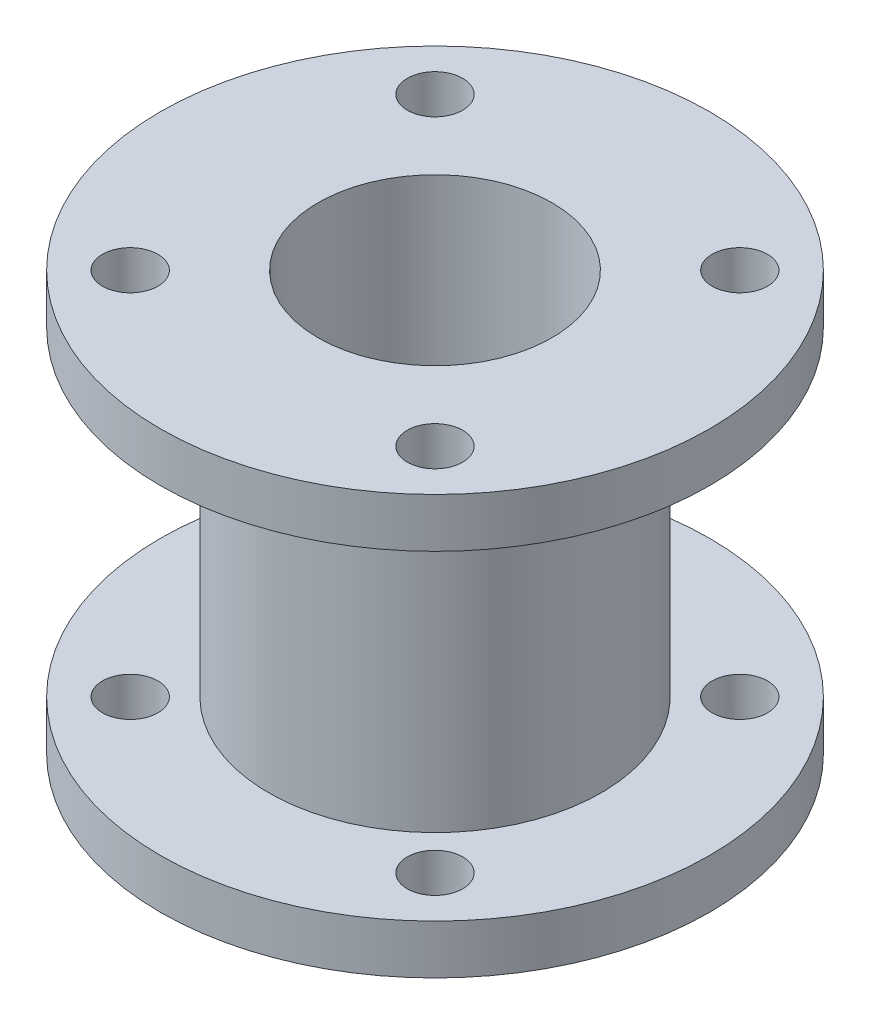
ISO-10303-21;
HEADER;
FILE_DESCRIPTION(('STEP AP214'),'2;1');
FILE_NAME('part.step','',(''),(''),'','','');
FILE_SCHEMA(('AUTOMOTIVE_DESIGN { 1 0 10303 214 1 1 1 1 }'));
ENDSEC;
DATA;
#1=APPLICATION_CONTEXT('core data for automotive mechanical design processes');
#2=APPLICATION_PROTOCOL_DEFINITION('international standard','automotive_design',2000,#1);
#3=PRODUCT_CONTEXT('',#1,'mechanical');
#4=PRODUCT('Part','Part','',(#3));
#5=PRODUCT_RELATED_PRODUCT_CATEGORY('part','',(#4));
#6=PRODUCT_DEFINITION_FORMATION('','',#4);
#7=PRODUCT_DEFINITION_CONTEXT('part definition',#1,'design');
#8=PRODUCT_DEFINITION('design','',#6,#7);
#9=PRODUCT_DEFINITION_SHAPE('','',#8);
#10=(LENGTH_UNIT() NAMED_UNIT(*) SI_UNIT(.MILLI.,.METRE.));
#11=(NAMED_UNIT(*) PLANE_ANGLE_UNIT() SI_UNIT($,.RADIAN.));
#12=(NAMED_UNIT(*) SI_UNIT($,.STERADIAN.) SOLID_ANGLE_UNIT());
#13=UNCERTAINTY_MEASURE_WITH_UNIT(LENGTH_MEASURE(1.E-05),#10,'distance_accuracy_value','');
#14=(GEOMETRIC_REPRESENTATION_CONTEXT(3) GLOBAL_UNCERTAINTY_ASSIGNED_CONTEXT((#13)) GLOBAL_UNIT_ASSIGNED_CONTEXT((#10,
#11,#12)) REPRESENTATION_CONTEXT('',''));
#15=CARTESIAN_POINT('',(0.,0.,0.));
#16=DIRECTION('',(0.,0.,1.));
#17=DIRECTION('',(1.,0.,0.));
#18=AXIS2_PLACEMENT_3D('',#15,#16,#17);
#19=CARTESIAN_POINT('',(9.5,30.,0.));
#20=DIRECTION('',(0.,1.,0.));
#21=DIRECTION('',(0.,0.,1.));
#22=AXIS2_PLACEMENT_3D('',#19,#20,#21);
#23=PLANE('',#22);
#24=CARTESIAN_POINT('',(-12.3743686707646,30.,12.3743686707646));
#25=DIRECTION('',(0.,-1.,0.));
#26=DIRECTION('',(0.,0.,-1.));
#27=AXIS2_PLACEMENT_3D('',#24,#25,#26);
#28=CIRCLE('',#27,2.25);
#29=CARTESIAN_POINT('',(-12.3743686707646,30.,10.1243686707646));
#30=VERTEX_POINT('',#29);
#31=EDGE_CURVE('E129',#30,#30,#28,.T.);
#32=ORIENTED_EDGE('',*,*,#31,.T.);
#33=EDGE_LOOP('',(#32));
#34=FACE_BOUND('',#33,.T.);
#35=CARTESIAN_POINT('',(12.3743686707646,30.,12.3743686707646));
#36=DIRECTION('',(0.,-1.,0.));
#37=DIRECTION('',(0.,0.,-1.));
#38=AXIS2_PLACEMENT_3D('',#35,#36,#37);
#39=CIRCLE('',#38,2.25);
#40=CARTESIAN_POINT('',(12.3743686707646,30.,10.1243686707646));
#41=VERTEX_POINT('',#40);
#42=EDGE_CURVE('E57',#41,#41,#39,.T.);
#43=ORIENTED_EDGE('',*,*,#42,.T.);
#44=EDGE_LOOP('',(#43));
#45=FACE_BOUND('',#44,.T.);
#46=CARTESIAN_POINT('',(12.3743686707646,30.,-12.3743686707646));
#47=DIRECTION('',(0.,-1.,0.));
#48=DIRECTION('',(0.,0.,-1.));
#49=AXIS2_PLACEMENT_3D('',#46,#47,#48);
#50=CIRCLE('',#49,2.25);
#51=CARTESIAN_POINT('',(12.3743686707646,30.,-14.6243686707646));
#52=VERTEX_POINT('',#51);
#53=EDGE_CURVE('E53',#52,#52,#50,.T.);
#54=ORIENTED_EDGE('',*,*,#53,.T.);
#55=EDGE_LOOP('',(#54));
#56=FACE_BOUND('',#55,.T.);
#57=CARTESIAN_POINT('',(-12.3743686707646,30.,-12.3743686707646));
#58=DIRECTION('',(0.,-1.,0.));
#59=DIRECTION('',(0.,0.,-1.));
#60=AXIS2_PLACEMENT_3D('',#57,#58,#59);
#61=CIRCLE('',#60,2.25);
#62=CARTESIAN_POINT('',(-12.3743686707646,30.,-14.6243686707646));
#63=VERTEX_POINT('',#62);
#64=EDGE_CURVE('E49',#63,#63,#61,.T.);
#65=ORIENTED_EDGE('',*,*,#64,.T.);
#66=EDGE_LOOP('',(#65));
#67=FACE_BOUND('',#66,.T.);
#68=CARTESIAN_POINT('',(0.,30.,0.));
#69=DIRECTION('',(0.,-1.,0.));
#70=DIRECTION('',(0.,0.,-1.));
#71=AXIS2_PLACEMENT_3D('',#68,#69,#70);
#72=CIRCLE('',#71,9.5);
#73=CARTESIAN_POINT('',(0.,30.,-9.5));
#74=VERTEX_POINT('',#73);
#75=EDGE_CURVE('E10',#74,#74,#72,.T.);
#76=ORIENTED_EDGE('',*,*,#75,.T.);
#77=EDGE_LOOP('',(#76));
#78=FACE_BOUND('',#77,.T.);
#79=CARTESIAN_POINT('',(0.,30.,0.));
#80=DIRECTION('',(0.,-1.,0.));
#81=DIRECTION('',(0.,0.,-1.));
#82=AXIS2_PLACEMENT_3D('',#79,#80,#81);
#83=CIRCLE('',#82,22.3);
#84=CARTESIAN_POINT('',(0.,30.,-22.3));
#85=VERTEX_POINT('',#84);
#86=EDGE_CURVE('E86',#85,#85,#83,.T.);
#87=ORIENTED_EDGE('',*,*,#86,.F.);
#88=EDGE_LOOP('',(#87));
#89=FACE_BOUND('',#88,.T.);
#90=ADVANCED_FACE('F29',(#34,#45,#56,#67,#78,#89),#23,.T.);
#91=CARTESIAN_POINT('',(0.,0.,0.));
#92=DIRECTION('',(0.,-1.,0.));
#93=DIRECTION('',(0.,0.,-1.));
#94=AXIS2_PLACEMENT_3D('',#91,#92,#93);
#95=CYLINDRICAL_SURFACE('',#94,9.5);
#96=CARTESIAN_POINT('',(0.,-4.,0.));
#97=DIRECTION('',(0.,-1.,0.));
#98=DIRECTION('',(0.,0.,-1.));
#99=AXIS2_PLACEMENT_3D('',#96,#97,#98);
#100=CIRCLE('',#99,9.5);
#101=CARTESIAN_POINT('',(0.,-4.,-9.5));
#102=VERTEX_POINT('',#101);
#103=EDGE_CURVE('E36',#102,#102,#100,.T.);
#104=ORIENTED_EDGE('',*,*,#103,.T.);
#105=EDGE_LOOP('',(#104));
#106=FACE_BOUND('',#105,.T.);
#107=ORIENTED_EDGE('',*,*,#75,.F.);
#108=EDGE_LOOP('',(#107));
#109=FACE_BOUND('',#108,.T.);
#110=ADVANCED_FACE('F118',(#106,#109),#95,.F.);
#111=CARTESIAN_POINT('',(22.3,-4.,0.));
#112=DIRECTION('',(0.,-1.,0.));
#113=DIRECTION('',(0.,0.,-1.));
#114=AXIS2_PLACEMENT_3D('',#111,#112,#113);
#115=PLANE('',#114);
#116=CARTESIAN_POINT('',(-12.3743686707646,-4.,12.3743686707646));
#117=DIRECTION('',(0.,-1.,0.));
#118=DIRECTION('',(0.,0.,-1.));
#119=AXIS2_PLACEMENT_3D('',#116,#117,#118);
#120=CIRCLE('',#119,2.24999999999999);
#121=CARTESIAN_POINT('',(-12.3743686707646,-4.,10.1243686707646));
#122=VERTEX_POINT('',#121);
#123=EDGE_CURVE('E187',#122,#122,#120,.T.);
#124=ORIENTED_EDGE('',*,*,#123,.F.);
#125=EDGE_LOOP('',(#124));
#126=FACE_BOUND('',#125,.T.);
#127=CARTESIAN_POINT('',(12.3743686707646,-4.,12.3743686707646));
#128=DIRECTION('',(0.,-1.,0.));
#129=DIRECTION('',(0.,0.,-1.));
#130=AXIS2_PLACEMENT_3D('',#127,#128,#129);
#131=CIRCLE('',#130,2.24999999999999);
#132=CARTESIAN_POINT('',(12.3743686707646,-4.,10.1243686707646));
#133=VERTEX_POINT('',#132);
#134=EDGE_CURVE('E64',#133,#133,#131,.T.);
#135=ORIENTED_EDGE('',*,*,#134,.F.);
#136=EDGE_LOOP('',(#135));
#137=FACE_BOUND('',#136,.T.);
#138=CARTESIAN_POINT('',(12.3743686707646,-4.,-12.3743686707646));
#139=DIRECTION('',(0.,-1.,0.));
#140=DIRECTION('',(0.,0.,-1.));
#141=AXIS2_PLACEMENT_3D('',#138,#139,#140);
#142=CIRCLE('',#141,2.24999999999999);
#143=CARTESIAN_POINT('',(12.3743686707646,-4.,-14.6243686707646));
#144=VERTEX_POINT('',#143);
#145=EDGE_CURVE('E61',#144,#144,#142,.T.);
#146=ORIENTED_EDGE('',*,*,#145,.F.);
#147=EDGE_LOOP('',(#146));
#148=FACE_BOUND('',#147,.T.);
#149=CARTESIAN_POINT('',(-12.3743686707646,-4.,-12.3743686707646));
#150=DIRECTION('',(0.,-1.,0.));
#151=DIRECTION('',(0.,0.,-1.));
#152=AXIS2_PLACEMENT_3D('',#149,#150,#151);
#153=CIRCLE('',#152,2.24999999999999);
#154=CARTESIAN_POINT('',(-12.3743686707646,-4.,-14.6243686707646));
#155=VERTEX_POINT('',#154);
#156=EDGE_CURVE('E79',#155,#155,#153,.T.);
#157=ORIENTED_EDGE('',*,*,#156,.F.);
#158=EDGE_LOOP('',(#157));
#159=FACE_BOUND('',#158,.T.);
#160=CARTESIAN_POINT('',(0.,-4.,0.));
#161=DIRECTION('',(0.,-1.,0.));
#162=DIRECTION('',(0.,0.,-1.));
#163=AXIS2_PLACEMENT_3D('',#160,#161,#162);
#164=CIRCLE('',#163,22.3);
#165=CARTESIAN_POINT('',(0.,-4.,-22.3));
#166=VERTEX_POINT('',#165);
#167=EDGE_CURVE('E41',#166,#166,#164,.T.);
#168=ORIENTED_EDGE('',*,*,#167,.T.);
#169=EDGE_LOOP('',(#168));
#170=FACE_BOUND('',#169,.T.);
#171=ORIENTED_EDGE('',*,*,#103,.F.);
#172=EDGE_LOOP('',(#171));
#173=FACE_BOUND('',#172,.T.);
#174=ADVANCED_FACE('F103',(#126,#137,#148,#159,#170,#173),#115,.T.);
#175=CARTESIAN_POINT('',(0.,0.,0.));
#176=DIRECTION('',(0.,-1.,0.));
#177=DIRECTION('',(0.,0.,-1.));
#178=AXIS2_PLACEMENT_3D('',#175,#176,#177);
#179=CYLINDRICAL_SURFACE('',#178,22.3);
#180=CARTESIAN_POINT('',(0.,0.,0.));
#181=DIRECTION('',(0.,-1.,0.));
#182=DIRECTION('',(0.,0.,-1.));
#183=AXIS2_PLACEMENT_3D('',#180,#181,#182);
#184=CIRCLE('',#183,22.3);
#185=CARTESIAN_POINT('',(0.,0.,-22.3));
#186=VERTEX_POINT('',#185);
#187=EDGE_CURVE('E98',#186,#186,#184,.T.);
#188=ORIENTED_EDGE('',*,*,#187,.T.);
#189=EDGE_LOOP('',(#188));
#190=FACE_BOUND('',#189,.T.);
#191=ORIENTED_EDGE('',*,*,#167,.F.);
#192=EDGE_LOOP('',(#191));
#193=FACE_BOUND('',#192,.T.);
#194=ADVANCED_FACE('F106',(#190,#193),#179,.T.);
#195=CARTESIAN_POINT('',(13.5,0.,0.));
#196=DIRECTION('',(0.,1.,0.));
#197=DIRECTION('',(0.,0.,1.));
#198=AXIS2_PLACEMENT_3D('',#195,#196,#197);
#199=PLANE('',#198);
#200=CARTESIAN_POINT('',(-12.3743686707646,0.,12.3743686707646));
#201=DIRECTION('',(0.,1.,0.));
#202=DIRECTION('',(0.,0.,1.));
#203=AXIS2_PLACEMENT_3D('',#200,#201,#202);
#204=CIRCLE('',#203,2.24999999999999);
#205=CARTESIAN_POINT('',(-12.3743686707646,0.,14.6243686707646));
#206=VERTEX_POINT('',#205);
#207=EDGE_CURVE('E69',#206,#206,#204,.T.);
#208=ORIENTED_EDGE('',*,*,#207,.F.);
#209=EDGE_LOOP('',(#208));
#210=FACE_BOUND('',#209,.T.);
#211=CARTESIAN_POINT('',(12.3743686707646,0.,12.3743686707646));
#212=DIRECTION('',(0.,1.,0.));
#213=DIRECTION('',(0.,0.,1.));
#214=AXIS2_PLACEMENT_3D('',#211,#212,#213);
#215=CIRCLE('',#214,2.24999999999999);
#216=CARTESIAN_POINT('',(12.3743686707646,0.,14.6243686707646));
#217=VERTEX_POINT('',#216);
#218=EDGE_CURVE('E56',#217,#217,#215,.T.);
#219=ORIENTED_EDGE('',*,*,#218,.F.);
#220=EDGE_LOOP('',(#219));
#221=FACE_BOUND('',#220,.T.);
#222=CARTESIAN_POINT('',(12.3743686707646,0.,-12.3743686707646));
#223=DIRECTION('',(0.,1.,0.));
#224=DIRECTION('',(0.,0.,1.));
#225=AXIS2_PLACEMENT_3D('',#222,#223,#224);
#226=CIRCLE('',#225,2.24999999999999);
#227=CARTESIAN_POINT('',(12.3743686707646,0.,-10.1243686707646));
#228=VERTEX_POINT('',#227);
#229=EDGE_CURVE('E52',#228,#228,#226,.T.);
#230=ORIENTED_EDGE('',*,*,#229,.F.);
#231=EDGE_LOOP('',(#230));
#232=FACE_BOUND('',#231,.T.);
#233=CARTESIAN_POINT('',(-12.3743686707646,0.,-12.3743686707646));
#234=DIRECTION('',(0.,1.,0.));
#235=DIRECTION('',(0.,0.,1.));
#236=AXIS2_PLACEMENT_3D('',#233,#234,#235);
#237=CIRCLE('',#236,2.24999999999999);
#238=CARTESIAN_POINT('',(-12.3743686707646,0.,-10.1243686707646));
#239=VERTEX_POINT('',#238);
#240=EDGE_CURVE('E48',#239,#239,#237,.T.);
#241=ORIENTED_EDGE('',*,*,#240,.F.);
#242=EDGE_LOOP('',(#241));
#243=FACE_BOUND('',#242,.T.);
#244=CARTESIAN_POINT('',(0.,0.,0.));
#245=DIRECTION('',(0.,-1.,0.));
#246=DIRECTION('',(0.,0.,-1.));
#247=AXIS2_PLACEMENT_3D('',#244,#245,#246);
#248=CIRCLE('',#247,13.5);
#249=CARTESIAN_POINT('',(0.,0.,-13.5));
#250=VERTEX_POINT('',#249);
#251=EDGE_CURVE('E95',#250,#250,#248,.T.);
#252=ORIENTED_EDGE('',*,*,#251,.T.);
#253=EDGE_LOOP('',(#252));
#254=FACE_BOUND('',#253,.T.);
#255=ORIENTED_EDGE('',*,*,#187,.F.);
#256=EDGE_LOOP('',(#255));
#257=FACE_BOUND('',#256,.T.);
#258=ADVANCED_FACE('F108',(#210,#221,#232,#243,#254,#257),#199,.T.);
#259=CARTESIAN_POINT('',(0.,0.,0.));
#260=DIRECTION('',(0.,-1.,0.));
#261=DIRECTION('',(0.,0.,-1.));
#262=AXIS2_PLACEMENT_3D('',#259,#260,#261);
#263=CYLINDRICAL_SURFACE('',#262,13.5);
#264=CARTESIAN_POINT('',(0.,26.,0.));
#265=DIRECTION('',(0.,-1.,0.));
#266=DIRECTION('',(0.,0.,-1.));
#267=AXIS2_PLACEMENT_3D('',#264,#265,#266);
#268=CIRCLE('',#267,13.5);
#269=CARTESIAN_POINT('',(0.,26.,-13.5));
#270=VERTEX_POINT('',#269);
#271=EDGE_CURVE('E92',#270,#270,#268,.T.);
#272=ORIENTED_EDGE('',*,*,#271,.T.);
#273=EDGE_LOOP('',(#272));
#274=FACE_BOUND('',#273,.T.);
#275=ORIENTED_EDGE('',*,*,#251,.F.);
#276=EDGE_LOOP('',(#275));
#277=FACE_BOUND('',#276,.T.);
#278=ADVANCED_FACE('F115',(#274,#277),#263,.T.);
#279=CARTESIAN_POINT('',(13.5,26.,0.));
#280=DIRECTION('',(0.,-1.,0.));
#281=DIRECTION('',(0.,0.,-1.));
#282=AXIS2_PLACEMENT_3D('',#279,#280,#281);
#283=PLANE('',#282);
#284=CARTESIAN_POINT('',(-12.3743686707646,26.,12.3743686707646));
#285=DIRECTION('',(0.,-1.,0.));
#286=DIRECTION('',(0.,0.,-1.));
#287=AXIS2_PLACEMENT_3D('',#284,#285,#286);
#288=CIRCLE('',#287,2.24999999999999);
#289=CARTESIAN_POINT('',(-12.3743686707646,26.,10.1243686707646));
#290=VERTEX_POINT('',#289);
#291=EDGE_CURVE('E32',#290,#290,#288,.T.);
#292=ORIENTED_EDGE('',*,*,#291,.F.);
#293=EDGE_LOOP('',(#292));
#294=FACE_BOUND('',#293,.T.);
#295=CARTESIAN_POINT('',(12.3743686707646,26.,12.3743686707646));
#296=DIRECTION('',(0.,-1.,0.));
#297=DIRECTION('',(0.,0.,-1.));
#298=AXIS2_PLACEMENT_3D('',#295,#296,#297);
#299=CIRCLE('',#298,2.24999999999999);
#300=CARTESIAN_POINT('',(12.3743686707646,26.,10.1243686707646));
#301=VERTEX_POINT('',#300);
#302=EDGE_CURVE('E54',#301,#301,#299,.T.);
#303=ORIENTED_EDGE('',*,*,#302,.F.);
#304=EDGE_LOOP('',(#303));
#305=FACE_BOUND('',#304,.T.);
#306=CARTESIAN_POINT('',(12.3743686707646,26.,-12.3743686707646));
#307=DIRECTION('',(0.,-1.,0.));
#308=DIRECTION('',(0.,0.,-1.));
#309=AXIS2_PLACEMENT_3D('',#306,#307,#308);
#310=CIRCLE('',#309,2.24999999999999);
#311=CARTESIAN_POINT('',(12.3743686707646,26.,-14.6243686707646));
#312=VERTEX_POINT('',#311);
#313=EDGE_CURVE('E50',#312,#312,#310,.T.);
#314=ORIENTED_EDGE('',*,*,#313,.F.);
#315=EDGE_LOOP('',(#314));
#316=FACE_BOUND('',#315,.T.);
#317=CARTESIAN_POINT('',(-12.3743686707646,26.,-12.3743686707646));
#318=DIRECTION('',(0.,-1.,0.));
#319=DIRECTION('',(0.,0.,-1.));
#320=AXIS2_PLACEMENT_3D('',#317,#318,#319);
#321=CIRCLE('',#320,2.24999999999999);
#322=CARTESIAN_POINT('',(-12.3743686707646,26.,-14.6243686707646));
#323=VERTEX_POINT('',#322);
#324=EDGE_CURVE('E45',#323,#323,#321,.T.);
#325=ORIENTED_EDGE('',*,*,#324,.F.);
#326=EDGE_LOOP('',(#325));
#327=FACE_BOUND('',#326,.T.);
#328=CARTESIAN_POINT('',(0.,26.,0.));
#329=DIRECTION('',(0.,-1.,0.));
#330=DIRECTION('',(0.,0.,-1.));
#331=AXIS2_PLACEMENT_3D('',#328,#329,#330);
#332=CIRCLE('',#331,22.3);
#333=CARTESIAN_POINT('',(0.,26.,-22.3));
#334=VERTEX_POINT('',#333);
#335=EDGE_CURVE('E89',#334,#334,#332,.T.);
#336=ORIENTED_EDGE('',*,*,#335,.T.);
#337=EDGE_LOOP('',(#336));
#338=FACE_BOUND('',#337,.T.);
#339=ORIENTED_EDGE('',*,*,#271,.F.);
#340=EDGE_LOOP('',(#339));
#341=FACE_BOUND('',#340,.T.);
#342=ADVANCED_FACE('F141',(#294,#305,#316,#327,#338,#341),#283,.T.);
#343=CARTESIAN_POINT('',(0.,0.,0.));
#344=DIRECTION('',(0.,-1.,0.));
#345=DIRECTION('',(0.,0.,-1.));
#346=AXIS2_PLACEMENT_3D('',#343,#344,#345);
#347=CYLINDRICAL_SURFACE('',#346,22.3);
#348=ORIENTED_EDGE('',*,*,#86,.T.);
#349=EDGE_LOOP('',(#348));
#350=FACE_BOUND('',#349,.T.);
#351=ORIENTED_EDGE('',*,*,#335,.F.);
#352=EDGE_LOOP('',(#351));
#353=FACE_BOUND('',#352,.T.);
#354=ADVANCED_FACE('F137',(#350,#353),#347,.T.);
#355=CARTESIAN_POINT('',(-12.3743686707646,-4.,-12.3743686707646));
#356=DIRECTION('',(0.,-1.,0.));
#357=DIRECTION('',(0.,0.,-1.));
#358=AXIS2_PLACEMENT_3D('',#355,#356,#357);
#359=CYLINDRICAL_SURFACE('',#358,2.24999999999999);
#360=ORIENTED_EDGE('',*,*,#324,.T.);
#361=EDGE_LOOP('',(#360));
#362=FACE_BOUND('',#361,.T.);
#363=ORIENTED_EDGE('',*,*,#64,.F.);
#364=EDGE_LOOP('',(#363));
#365=FACE_BOUND('',#364,.T.);
#366=ADVANCED_FACE('F140',(#362,#365),#359,.F.);
#367=ORIENTED_EDGE('',*,*,#240,.T.);
#368=EDGE_LOOP('',(#367));
#369=FACE_BOUND('',#368,.T.);
#370=ORIENTED_EDGE('',*,*,#156,.T.);
#371=EDGE_LOOP('',(#370));
#372=FACE_BOUND('',#371,.T.);
#373=ADVANCED_FACE('F163',(#369,#372),#359,.F.);
#374=CARTESIAN_POINT('',(12.3743686707646,-4.,-12.3743686707646));
#375=DIRECTION('',(0.,-1.,0.));
#376=DIRECTION('',(0.,0.,-1.));
#377=AXIS2_PLACEMENT_3D('',#374,#375,#376);
#378=CYLINDRICAL_SURFACE('',#377,2.24999999999999);
#379=ORIENTED_EDGE('',*,*,#313,.T.);
#380=EDGE_LOOP('',(#379));
#381=FACE_BOUND('',#380,.T.);
#382=ORIENTED_EDGE('',*,*,#53,.F.);
#383=EDGE_LOOP('',(#382));
#384=FACE_BOUND('',#383,.T.);
#385=ADVANCED_FACE('F165',(#381,#384),#378,.F.);
#386=ORIENTED_EDGE('',*,*,#229,.T.);
#387=EDGE_LOOP('',(#386));
#388=FACE_BOUND('',#387,.T.);
#389=ORIENTED_EDGE('',*,*,#145,.T.);
#390=EDGE_LOOP('',(#389));
#391=FACE_BOUND('',#390,.T.);
#392=ADVANCED_FACE('F168',(#388,#391),#378,.F.);
#393=CARTESIAN_POINT('',(12.3743686707646,-4.,12.3743686707646));
#394=DIRECTION('',(0.,-1.,0.));
#395=DIRECTION('',(0.,0.,-1.));
#396=AXIS2_PLACEMENT_3D('',#393,#394,#395);
#397=CYLINDRICAL_SURFACE('',#396,2.24999999999999);
#398=ORIENTED_EDGE('',*,*,#302,.T.);
#399=EDGE_LOOP('',(#398));
#400=FACE_BOUND('',#399,.T.);
#401=ORIENTED_EDGE('',*,*,#42,.F.);
#402=EDGE_LOOP('',(#401));
#403=FACE_BOUND('',#402,.T.);
#404=ADVANCED_FACE('F170',(#400,#403),#397,.F.);
#405=ORIENTED_EDGE('',*,*,#218,.T.);
#406=EDGE_LOOP('',(#405));
#407=FACE_BOUND('',#406,.T.);
#408=ORIENTED_EDGE('',*,*,#134,.T.);
#409=EDGE_LOOP('',(#408));
#410=FACE_BOUND('',#409,.T.);
#411=ADVANCED_FACE('F173',(#407,#410),#397,.F.);
#412=CARTESIAN_POINT('',(-12.3743686707646,-4.,12.3743686707646));
#413=DIRECTION('',(0.,-1.,0.));
#414=DIRECTION('',(0.,0.,-1.));
#415=AXIS2_PLACEMENT_3D('',#412,#413,#414);
#416=CYLINDRICAL_SURFACE('',#415,2.24999999999999);
#417=ORIENTED_EDGE('',*,*,#291,.T.);
#418=EDGE_LOOP('',(#417));
#419=FACE_BOUND('',#418,.T.);
#420=ORIENTED_EDGE('',*,*,#31,.F.);
#421=EDGE_LOOP('',(#420));
#422=FACE_BOUND('',#421,.T.);
#423=ADVANCED_FACE('F174',(#419,#422),#416,.F.);
#424=ORIENTED_EDGE('',*,*,#207,.T.);
#425=EDGE_LOOP('',(#424));
#426=FACE_BOUND('',#425,.T.);
#427=ORIENTED_EDGE('',*,*,#123,.T.);
#428=EDGE_LOOP('',(#427));
#429=FACE_BOUND('',#428,.T.);
#430=ADVANCED_FACE('F176',(#426,#429),#416,.F.);
#431=CLOSED_SHELL('',(#90,#110,#174,#194,#258,#278,#342,#354,#366,#373,#385,#392,#404,#411,#423,#430));
#432=MANIFOLD_SOLID_BREP('B2',#431);
#433=ADVANCED_BREP_SHAPE_REPRESENTATION('',(#18,#432),#14);
#434=SHAPE_DEFINITION_REPRESENTATION(#9,#433);
ENDSEC;
END-ISO-10303-21;
